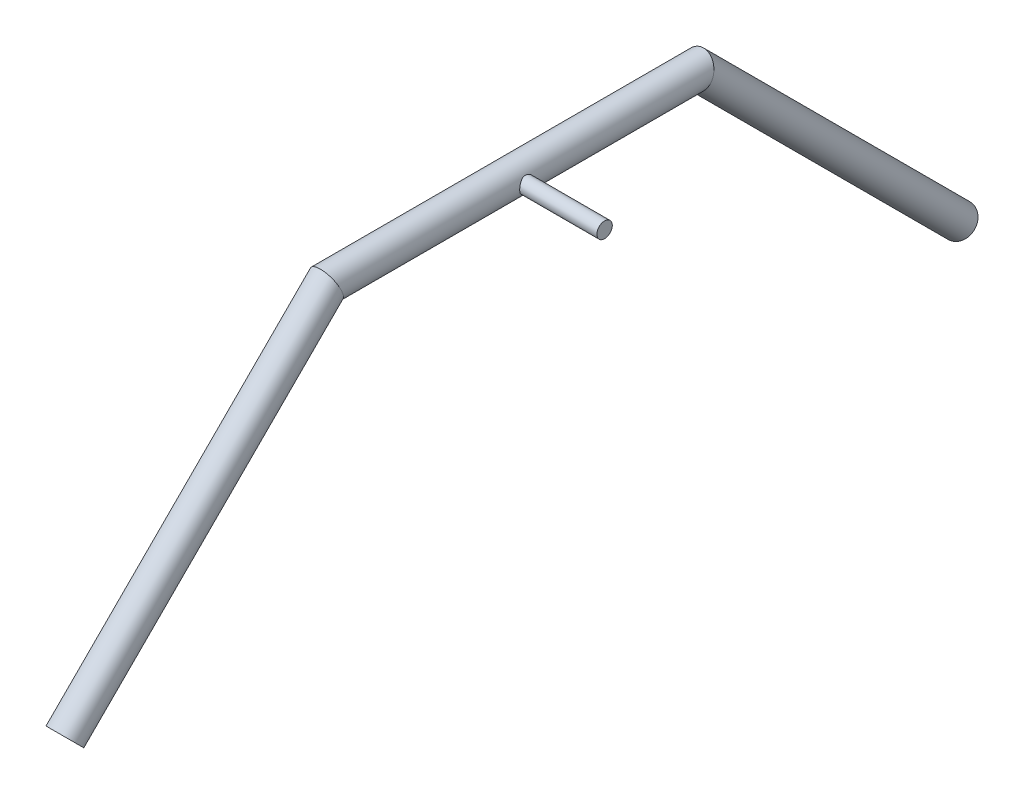
ISO-10303-21;
HEADER;
FILE_DESCRIPTION(('STEP AP214'),'2;1');
FILE_NAME('part.step','',(''),(''),'','','');
FILE_SCHEMA(('AUTOMOTIVE_DESIGN { 1 0 10303 214 1 1 1 1 }'));
ENDSEC;
DATA;
#1=APPLICATION_CONTEXT('core data for automotive mechanical design processes');
#2=APPLICATION_PROTOCOL_DEFINITION('international standard','automotive_design',2000,#1);
#3=PRODUCT_CONTEXT('',#1,'mechanical');
#4=PRODUCT('Part','Part','',(#3));
#5=PRODUCT_RELATED_PRODUCT_CATEGORY('part','',(#4));
#6=PRODUCT_DEFINITION_FORMATION('','',#4);
#7=PRODUCT_DEFINITION_CONTEXT('part definition',#1,'design');
#8=PRODUCT_DEFINITION('design','',#6,#7);
#9=PRODUCT_DEFINITION_SHAPE('','',#8);
#10=(LENGTH_UNIT() NAMED_UNIT(*) SI_UNIT(.MILLI.,.METRE.));
#11=(NAMED_UNIT(*) PLANE_ANGLE_UNIT() SI_UNIT($,.RADIAN.));
#12=(NAMED_UNIT(*) SI_UNIT($,.STERADIAN.) SOLID_ANGLE_UNIT());
#13=UNCERTAINTY_MEASURE_WITH_UNIT(LENGTH_MEASURE(1.E-05),#10,'distance_accuracy_value','');
#14=(GEOMETRIC_REPRESENTATION_CONTEXT(3) GLOBAL_UNCERTAINTY_ASSIGNED_CONTEXT((#13)) GLOBAL_UNIT_ASSIGNED_CONTEXT((#10,
#11,#12)) REPRESENTATION_CONTEXT('',''));
#15=CARTESIAN_POINT('',(0.,0.,0.));
#16=DIRECTION('',(0.,0.,1.));
#17=DIRECTION('',(1.,0.,0.));
#18=AXIS2_PLACEMENT_3D('',#15,#16,#17);
#19=CARTESIAN_POINT('',(0.,-1.4897870406127,38.5426953965743));
#20=DIRECTION('',(0.,0.,-1.));
#21=DIRECTION('',(-1.,0.,0.));
#22=AXIS2_PLACEMENT_3D('',#19,#20,#21);
#23=CYLINDRICAL_SURFACE('',#22,12.7);
#24=CARTESIAN_POINT('',(0.,-1.4897870406127,32.6561319302221));
#25=DIRECTION('',(0.,0.382683432365091,-0.923879532511286));
#26=DIRECTION('',(0.,0.923879532511286,0.382683432365091));
#27=AXIS2_PLACEMENT_3D('',#24,#25,#26);
#28=ELLIPSE('',#27,13.7463809437134,12.7);
#29=CARTESIAN_POINT('',(0.,11.2102129593873,37.9166441723604));
#30=VERTEX_POINT('',#29);
#31=EDGE_CURVE('E62',#30,#30,#28,.T.);
#32=ORIENTED_EDGE('',*,*,#31,.T.);
#33=EDGE_LOOP('',(#32));
#34=FACE_BOUND('',#33,.T.);
#35=CARTESIAN_POINT('',(0.,-1.4897870406127,-272.143868069778));
#36=DIRECTION('',(0.,-0.382683432365091,-0.923879532511286));
#37=DIRECTION('',(0.,0.923879532511287,-0.382683432365091));
#38=AXIS2_PLACEMENT_3D('',#35,#36,#37);
#39=ELLIPSE('',#38,13.7463809437134,12.7);
#40=CARTESIAN_POINT('',(0.,11.2102129593873,-277.404380311916));
#41=VERTEX_POINT('',#40);
#42=EDGE_CURVE('E124',#41,#41,#39,.T.);
#43=ORIENTED_EDGE('',*,*,#42,.F.);
#44=EDGE_LOOP('',(#43));
#45=FACE_BOUND('',#44,.T.);
#46=CARTESIAN_POINT('',(12.7,-1.4897870406127,-113.393868069778));
#47=CARTESIAN_POINT('',(12.6999994891774,-1.65677791980761,-113.393868627602));
#48=CARTESIAN_POINT('',(12.6966986728259,-1.82378049081133,-113.400462898579));
#49=CARTESIAN_POINT('',(12.6835786203218,-2.15655556725274,-113.42676474111));
#50=CARTESIAN_POINT('',(12.6737565484519,-2.32232750583582,-113.44647801737));
#51=CARTESIAN_POINT('',(12.6478292478082,-2.65156171789673,-113.498821868467));
#52=CARTESIAN_POINT('',(12.6317150589571,-2.81502035168104,-113.531470864958));
#53=CARTESIAN_POINT('',(12.5936085062318,-3.13828052309058,-113.609324399755));
#54=CARTESIAN_POINT('',(12.5716137398496,-3.29808053695416,-113.654534070016));
#55=CARTESIAN_POINT('',(12.5223959142721,-3.61222884940147,-113.756806889449));
#56=CARTESIAN_POINT('',(12.4951959650805,-3.76659780219676,-113.813817731834));
#57=CARTESIAN_POINT('',(12.436150269919,-4.06972158298842,-113.939267791719));
#58=CARTESIAN_POINT('',(12.4043027843762,-4.2184742824637,-114.007711289855));
#59=CARTESIAN_POINT('',(12.302881193969,-4.65491516254916,-114.229276396264));
#60=CARTESIAN_POINT('',(12.2273713354024,-4.93313208018793,-114.398746428739));
#61=CARTESIAN_POINT('',(12.0622186773861,-5.47450500182983,-114.787810575792));
#62=CARTESIAN_POINT('',(11.9719972312188,-5.73573158675631,-115.009816827984));
#63=CARTESIAN_POINT('',(11.7893960148839,-6.21915257216465,-115.492719878581));
#64=CARTESIAN_POINT('',(11.6970146601478,-6.44131722841707,-115.753646036034));
#65=CARTESIAN_POINT('',(11.5603243398217,-6.74934102839498,-116.181043203069));
#66=CARTESIAN_POINT('',(11.5134721485475,-6.85084974552579,-116.335664176016));
#67=CARTESIAN_POINT('',(11.4233099497228,-7.04037072821734,-116.653920454303));
#68=CARTESIAN_POINT('',(11.3799984680683,-7.12838862390478,-116.817551960308));
#69=CARTESIAN_POINT('',(11.2984098057888,-7.2901451235037,-117.152920205373));
#70=CARTESIAN_POINT('',(11.2601322945723,-7.36388466525522,-117.324656411172));
#71=CARTESIAN_POINT('',(11.1900882100937,-7.49624492897789,-117.675051126578));
#72=CARTESIAN_POINT('',(11.1583177917589,-7.55487458477507,-117.85370547357));
#73=CARTESIAN_POINT('',(11.104259497995,-7.65325884822883,-118.205844278748));
#74=CARTESIAN_POINT('',(11.08151961136,-7.69392953173717,-118.379003087267));
#75=CARTESIAN_POINT('',(11.0438804844397,-7.76068645741718,-118.728957979682));
#76=CARTESIAN_POINT('',(11.0289809087597,-7.78677332346183,-118.905753907653));
#77=CARTESIAN_POINT('',(11.0076763086804,-7.82394237980647,-119.261277364542));
#78=CARTESIAN_POINT('',(11.0012640993806,-7.83503726159646,-119.440003130374));
#79=CARTESIAN_POINT('',(10.9972004886715,-7.84207814818819,-119.797844612084));
#80=CARTESIAN_POINT('',(10.9995482514047,-7.83802559832464,-119.976960289129));
#81=CARTESIAN_POINT('',(11.012090292946,-7.81623881197733,-120.312450371653));
#82=CARTESIAN_POINT('',(11.0213095833287,-7.80020403536759,-120.468975429648));
#83=CARTESIAN_POINT('',(11.046128374712,-7.7566583855275,-120.779958604436));
#84=CARTESIAN_POINT('',(11.0617299789813,-7.72914372908407,-120.934416022499));
#85=CARTESIAN_POINT('',(11.0988027904553,-7.66295577509789,-121.24017936648));
#86=CARTESIAN_POINT('',(11.120273227066,-7.62428394248658,-121.391485703337));
#87=CARTESIAN_POINT('',(11.1684190383084,-7.53618489638032,-121.690106711781));
#88=CARTESIAN_POINT('',(11.1950964580098,-7.48675345611197,-121.83741978902));
#89=CARTESIAN_POINT('',(11.2831376118079,-7.32046703973683,-122.278796796713));
#90=CARTESIAN_POINT('',(11.351625656313,-7.18711862051005,-122.565418631972));
#91=CARTESIAN_POINT('',(11.500071400071,-6.88118584643924,-123.113444919895));
#92=CARTESIAN_POINT('',(11.5800342452273,-6.7085838678192,-123.374837970208));
#93=CARTESIAN_POINT('',(11.7546812882032,-6.30352420368694,-123.900055500737));
#94=CARTESIAN_POINT('',(11.8499465086129,-6.06625199945793,-124.159985740129));
#95=CARTESIAN_POINT('',(12.0362854764244,-5.5509097911418,-124.63807147064));
#96=CARTESIAN_POINT('',(12.1273572049436,-5.27282040062726,-124.856206996919));
#97=CARTESIAN_POINT('',(12.255938857257,-4.82265347800967,-125.152089444295));
#98=CARTESIAN_POINT('',(12.2983050254296,-4.66314426671061,-125.2472279165));
#99=CARTESIAN_POINT('',(12.3782218301755,-4.33548475687708,-125.423574781022));
#100=CARTESIAN_POINT('',(12.4157746297482,-4.16733838757132,-125.504789435907));
#101=CARTESIAN_POINT('',(12.4849579292559,-3.82357464405201,-125.652414640885));
#102=CARTESIAN_POINT('',(12.5165907293456,-3.64796020416409,-125.718830942643));
#103=CARTESIAN_POINT('',(12.5729876360055,-3.29053512580538,-125.83608972976));
#104=CARTESIAN_POINT('',(12.5977525327026,-3.10872520280673,-125.886934006693));
#105=CARTESIAN_POINT('',(12.6378915597613,-2.755723395467,-125.968815029523));
#106=CARTESIAN_POINT('',(12.6538736459652,-2.58489947760057,-126.001143656087));
#107=CARTESIAN_POINT('',(12.6789562420375,-2.24067835946114,-126.051713658141));
#108=CARTESIAN_POINT('',(12.6880571262137,-2.06728129967925,-126.069955799878));
#109=CARTESIAN_POINT('',(12.6991158370576,-1.71941665198612,-126.092106793677));
#110=CARTESIAN_POINT('',(12.7010765197081,-1.54494952006627,-126.096021376571));
#111=CARTESIAN_POINT('',(12.6978059034872,-1.19635653319513,-126.089479461829));
#112=CARTESIAN_POINT('',(12.6925749229034,-1.02223066348186,-126.079023600198));
#113=CARTESIAN_POINT('',(12.6757555094506,-0.689277503868629,-126.045254438257));
#114=CARTESIAN_POINT('',(12.6646934781011,-0.530314153448554,-126.023004995776));
#115=CARTESIAN_POINT('',(12.6368459564446,-0.214958640091404,-125.966646907296));
#116=CARTESIAN_POINT('',(12.6200585231077,-0.0585673689527108,-125.932534235195));
#117=CARTESIAN_POINT('',(12.581159973299,0.250520728027685,-125.852820116819));
#118=CARTESIAN_POINT('',(12.5590505630802,0.403218720721145,-125.807222352506));
#119=CARTESIAN_POINT('',(12.5099971792976,0.704118660112634,-125.704953678719));
#120=CARTESIAN_POINT('',(12.4830513245292,0.852318831001327,-125.648278459746));
#121=CARTESIAN_POINT('',(12.4240951779885,1.1474715217762,-125.522605775806));
#122=CARTESIAN_POINT('',(12.3919635638501,1.29427118289351,-125.453306064681));
#123=CARTESIAN_POINT('',(12.32392525103,1.58148052651925,-125.3040866757));
#124=CARTESIAN_POINT('',(12.2880172735192,1.72188802116851,-125.224163397842));
#125=CARTESIAN_POINT('',(12.1757741292216,2.13248672384417,-124.969318956096));
#126=CARTESIAN_POINT('',(12.0948877082824,2.39220836067138,-124.77925699099));
#127=CARTESIAN_POINT('',(11.9194499483036,2.90301290089874,-124.342728225611));
#128=CARTESIAN_POINT('',(11.8243367236915,3.1507428631143,-124.092555264645));
#129=CARTESIAN_POINT('',(11.6839772811164,3.48913691378379,-123.688957979926));
#130=CARTESIAN_POINT('',(11.6375432562751,3.59646676191905,-123.549591964638));
#131=CARTESIAN_POINT('',(11.5466734049483,3.79951204817738,-123.261934327099));
#132=CARTESIAN_POINT('',(11.5022378780468,3.89522574861524,-123.1136413744));
#133=CARTESIAN_POINT('',(11.4145838039713,4.07870685010253,-122.801439969167));
#134=CARTESIAN_POINT('',(11.3715304916549,4.16585845529205,-122.637122625727));
#135=CARTESIAN_POINT('',(11.290579644901,4.3257820531541,-122.300497535878));
#136=CARTESIAN_POINT('',(11.2526796279935,4.39856097720213,-122.128193690789));
#137=CARTESIAN_POINT('',(11.1834979926119,4.52891889153224,-121.776788905619));
#138=CARTESIAN_POINT('',(11.1522110654535,4.58651008309703,-121.597693554719));
#139=CARTESIAN_POINT('',(11.0975495796607,4.68577900994958,-121.233969731758));
#140=CARTESIAN_POINT('',(11.0741737959829,4.72745920918875,-121.049342121194));
#141=CARTESIAN_POINT('',(11.038221566145,4.79104599178573,-120.694129811253));
#142=CARTESIAN_POINT('',(11.0248238589961,4.81446663513222,-120.523898370593));
#143=CARTESIAN_POINT('',(11.0059068618669,4.84743482684167,-120.181662096087));
#144=CARTESIAN_POINT('',(11.0003870360907,4.85698331868744,-120.009657383646));
#145=CARTESIAN_POINT('',(10.9974561088362,4.86206051588589,-119.665436786344));
#146=CARTESIAN_POINT('',(11.0000420081603,4.85759440677727,-119.493221003152));
#147=CARTESIAN_POINT('',(11.0132073594892,4.83472372634817,-119.150034403732));
#148=CARTESIAN_POINT('',(11.023786484255,4.8163197256387,-118.979063536827));
#149=CARTESIAN_POINT('',(11.0511312712702,4.76826216657192,-118.656038379882));
#150=CARTESIAN_POINT('',(11.0672085028909,4.73985282658711,-118.503738751757));
#151=CARTESIAN_POINT('',(11.1050268373618,4.67218235062066,-118.20226770911));
#152=CARTESIAN_POINT('',(11.1267698205995,4.63291761161248,-118.053097350945));
#153=CARTESIAN_POINT('',(11.1995485940621,4.49941051488456,-117.61164373819));
#154=CARTESIAN_POINT('',(11.2581531108883,4.38942391610102,-117.325211050686));
#155=CARTESIAN_POINT('',(11.3937155944897,4.12243005274277,-116.755352064246));
#156=CARTESIAN_POINT('',(11.4716421113511,3.962760152483,-116.473420672326));
#157=CARTESIAN_POINT('',(11.635439817654,3.60388616889509,-115.938494996407));
#158=CARTESIAN_POINT('',(11.7213151279082,3.40466151762678,-115.685515875545));
#159=CARTESIAN_POINT('',(11.9038699110716,2.94375331211603,-115.18362981464));
#160=CARTESIAN_POINT('',(12.0005943076297,2.67742190853151,-114.938952637043));
#161=CARTESIAN_POINT('',(12.1383310810892,2.24834930257089,-114.607562019804));
#162=CARTESIAN_POINT('',(12.1830529217553,2.10025865671271,-114.502962977824));
#163=CARTESIAN_POINT('',(12.2688872478125,1.7949488582359,-114.306412892178));
#164=CARTESIAN_POINT('',(12.3100013738234,1.63773390953138,-114.214456088518));
#165=CARTESIAN_POINT('',(12.3878055405892,1.31382473336567,-114.043334961263));
#166=CARTESIAN_POINT('',(12.4244591999769,1.14706700677187,-113.964274249818));
#167=CARTESIAN_POINT('',(12.4919115290982,0.806356957012716,-113.82066178436));
#168=CARTESIAN_POINT('',(12.5227130740716,0.632408218327429,-113.756102902501));
#169=CARTESIAN_POINT('',(12.5775008101552,0.278938300784715,-113.642351329438));
#170=CARTESIAN_POINT('',(12.6015018553988,0.0994302321593499,-113.593125123776));
#171=CARTESIAN_POINT('',(12.642019952057,-0.263936499781345,-113.510532800744));
#172=CARTESIAN_POINT('',(12.6585415748002,-0.447792433229217,-113.477156995197));
#173=CARTESIAN_POINT('',(12.6806500718221,-0.774724011958794,-113.432635507854));
#174=CARTESIAN_POINT('',(12.6878936037074,-0.917238227961638,-113.41811016793));
#175=CARTESIAN_POINT('',(12.6975688534566,-1.20309442242374,-113.398726076059));
#176=CARTESIAN_POINT('',(12.7000004385074,-1.34643642362093,-113.393867590923));
#177=CARTESIAN_POINT('',(12.7,-1.4897870406127,-113.393868069778));
#178=B_SPLINE_CURVE_WITH_KNOTS('',3,(#46,#47,#48,#49,#50,#51,#52,#53,#54,#55,#56,#57,#58,#59,
#60,#61,#62,#63,#64,#65,#66,#67,#68,#69,#70,#71,#72,#73,#74,#75,#76,#77,#78,#79,#80,#81,#82,#83,
#84,#85,#86,#87,#88,#89,#90,#91,#92,#93,#94,#95,#96,#97,#98,#99,#100,#101,#102,#103,#104,#105,
#106,#107,#108,#109,#110,#111,#112,#113,#114,#115,#116,#117,#118,#119,#120,#121,#122,#123,#124,
#125,#126,#127,#128,#129,#130,#131,#132,#133,#134,#135,#136,#137,#138,#139,#140,#141,#142,#143,
#144,#145,#146,#147,#148,#149,#150,#151,#152,#153,#154,#155,#156,#157,#158,#159,#160,#161,#162,
#163,#164,#165,#166,#167,#168,#169,#170,#171,#172,#173,#174,#175,#176,#177),.UNSPECIFIED.,.T.,
.F.,(4,2,2,2,2,2,2,2,2,2,2,2,2,2,2,2,2,2,2,2,2,2,2,2,2,2,2,2,2,2,2,2,2,2,2,2,2,2,2,2,2,2,2,2,2,
2,2,2,2,2,2,2,2,2,2,2,2,2,2,2,2,2,2,2,2,4),(0.,0.500831224205358,1.00188037372803,
1.50364564290689,2.00561622220709,2.50540779268628,3.0053869172507,4.00425210956755,
5.06354639773445,6.12364383897771,6.69546056113471,7.26703799333406,7.83857787007115,
8.40977904053157,8.94696617231633,9.48413032231424,10.020839449589,10.5574973665628,
11.0297819407841,11.5022222802448,11.9746006167424,12.447164856978,13.4133450583963,
14.3799599077214,15.4691385823986,16.558836254714,17.1296896955319,17.7002857039293,
18.2706595507725,18.840967750957,19.3640345307036,19.8870728558157,20.4099019497636,
20.9327079051584,21.4148301207384,21.8971161172382,22.3792476958437,22.8615672144633,
23.3574791185916,23.8535595025871,24.845213267335,25.9342484207188,26.4795520760264,
27.0249372042285,27.5969396508644,28.1686655660688,28.7399307681393,29.3111074690516,
29.8274552059118,30.3437678229116,30.8598894217494,31.3759898919437,31.8427315926275,
32.3096283963947,33.2427989036526,34.2386648311406,35.2350499582129,36.3525027406484,
36.9121724680044,37.4715863502977,38.0352942497766,38.5987244700202,39.1609143479984,
39.7227601571806,40.1526787482413,40.5826092051903),.UNSPECIFIED.);
#179=CARTESIAN_POINT('',(12.7,-1.4897870406127,-113.393868069778));
#180=VERTEX_POINT('',#179);
#181=EDGE_CURVE('E11',#180,#180,#178,.T.);
#182=ORIENTED_EDGE('',*,*,#181,.F.);
#183=EDGE_LOOP('',(#182));
#184=FACE_BOUND('',#183,.T.);
#185=ADVANCED_FACE('F49',(#34,#45,#184),#23,.T.);
#186=CARTESIAN_POINT('',(0.,-1.48978704061267,37.0960545299863));
#187=DIRECTION('',(0.,0.,-1.));
#188=DIRECTION('',(-1.,0.,0.));
#189=AXIS2_PLACEMENT_3D('',#186,#187,#188);
#190=CYLINDRICAL_SURFACE('',#189,9.525);
#191=CARTESIAN_POINT('',(0.,-1.48978704061267,-272.143868069778));
#192=DIRECTION('',(0.,-0.382683432365091,-0.923879532511287));
#193=DIRECTION('',(0.,0.923879532511287,-0.382683432365091));
#194=AXIS2_PLACEMENT_3D('',#191,#192,#193);
#195=ELLIPSE('',#194,10.3097857077851,9.525);
#196=CARTESIAN_POINT('',(0.,8.03521295938733,-276.089252251382));
#197=VERTEX_POINT('',#196);
#198=EDGE_CURVE('E136',#197,#197,#195,.T.);
#199=ORIENTED_EDGE('',*,*,#198,.T.);
#200=EDGE_LOOP('',(#199));
#201=FACE_BOUND('',#200,.T.);
#202=CARTESIAN_POINT('',(0.,-1.48978704061256,32.6561319302221));
#203=DIRECTION('',(0.,0.382683432365091,-0.923879532511287));
#204=DIRECTION('',(0.,0.923879532511287,0.382683432365091));
#205=AXIS2_PLACEMENT_3D('',#202,#203,#204);
#206=ELLIPSE('',#205,10.3097857077851,9.525);
#207=CARTESIAN_POINT('',(0.,8.03521295938744,36.6015161118259));
#208=VERTEX_POINT('',#207);
#209=EDGE_CURVE('E134',#208,#208,#206,.T.);
#210=ORIENTED_EDGE('',*,*,#209,.F.);
#211=EDGE_LOOP('',(#210));
#212=FACE_BOUND('',#211,.T.);
#213=CARTESIAN_POINT('',(9.52500000000001,-1.4897870406127,-113.393868069778));
#214=CARTESIAN_POINT('',(9.52499995302127,-1.64930922529285,-113.393868116678));
#215=CARTESIAN_POINT('',(9.52098401348312,-1.80883221666415,-113.399887291772));
#216=CARTESIAN_POINT('',(9.50502147249805,-2.12657409223065,-113.423869032869));
#217=CARTESIAN_POINT('',(9.49307482930957,-2.28479296955748,-113.441831661733));
#218=CARTESIAN_POINT('',(9.46153969282097,-2.59874758910036,-113.489435560633));
#219=CARTESIAN_POINT('',(9.44194822064128,-2.75448233870052,-113.519081383179));
#220=CARTESIAN_POINT('',(9.39559036683439,-3.06228048590965,-113.589625713896));
#221=CARTESIAN_POINT('',(9.36882389844983,-3.21434383910125,-113.630524358131));
#222=CARTESIAN_POINT('',(9.30886537420495,-3.51308617199159,-113.722815357228));
#223=CARTESIAN_POINT('',(9.2757059421349,-3.65978817181756,-113.774154503377));
#224=CARTESIAN_POINT('',(9.2035713113691,-3.94783217303828,-113.886866631401));
#225=CARTESIAN_POINT('',(9.1645938472794,-4.08917205955641,-113.948243522615));
#226=CARTESIAN_POINT('',(9.04008640647303,-4.50402258574737,-114.146486048555));
#227=CARTESIAN_POINT('',(8.94692755885441,-4.76862219208656,-114.297544537793));
#228=CARTESIAN_POINT('',(8.73846290686175,-5.29120746012685,-114.646915476657));
#229=CARTESIAN_POINT('',(8.62194858766981,-5.54672657395838,-114.84815002851));
#230=CARTESIAN_POINT('',(8.38142132332393,-6.02283653690501,-115.285331001584));
#231=CARTESIAN_POINT('',(8.25739778727135,-6.24337638777616,-115.52132715493));
#232=CARTESIAN_POINT('',(8.06347927572664,-6.56173796199019,-115.918602359765));
#233=CARTESIAN_POINT('',(7.99276165906505,-6.67215605585161,-116.06954997759));
#234=CARTESIAN_POINT('',(7.85423181855953,-6.87980175525613,-116.381517753631));
#235=CARTESIAN_POINT('',(7.78642025681812,-6.9770263656721,-116.542540186906));
#236=CARTESIAN_POINT('',(7.59098753954933,-7.24754365030399,-117.039668971679));
#237=CARTESIAN_POINT('',(7.47095386772018,-7.40032724740184,-117.39063937361));
#238=CARTESIAN_POINT('',(7.30173884021222,-7.60720858103283,-118.019018551067));
#239=CARTESIAN_POINT('',(7.24210690604665,-7.67706306488747,-118.288408303811));
#240=CARTESIAN_POINT('',(7.17443610973183,-7.75510524308877,-118.700845704673));
#241=CARTESIAN_POINT('',(7.15551189712762,-7.77665944849341,-118.839660113549));
#242=CARTESIAN_POINT('',(7.1255840953054,-7.81056299642999,-119.119284759294));
#243=CARTESIAN_POINT('',(7.11458054949506,-7.82291228851621,-119.260095007098));
#244=CARTESIAN_POINT('',(7.10093685388961,-7.83820605740571,-119.543217701081));
#245=CARTESIAN_POINT('',(7.09833152574747,-7.84111137694439,-119.685533953271));
#246=CARTESIAN_POINT('',(7.10169083317634,-7.83735497956311,-119.969937038923));
#247=CARTESIAN_POINT('',(7.10765549785802,-7.83069323014559,-120.112023871604));
#248=CARTESIAN_POINT('',(7.12790820220153,-7.80791818180331,-120.394914829016));
#249=CARTESIAN_POINT('',(7.14220075299526,-7.7917997602619,-120.5357182165));
#250=CARTESIAN_POINT('',(7.17852290817034,-7.75039243299932,-120.814979596537));
#251=CARTESIAN_POINT('',(7.20055576995174,-7.72509966623925,-120.953436575882));
#252=CARTESIAN_POINT('',(7.27478957681072,-7.63866607320999,-121.351731969154));
#253=CARTESIAN_POINT('',(7.33620201701265,-7.5658444005062,-121.607423262154));
#254=CARTESIAN_POINT('',(7.47743075866494,-7.39115778214636,-122.10301535485));
#255=CARTESIAN_POINT('',(7.55725311438592,-7.2892832795868,-122.34291092654));
#256=CARTESIAN_POINT('',(7.74586039676384,-7.03568875038075,-122.852250602729));
#257=CARTESIAN_POINT('',(7.85723391455877,-6.87804480236335,-123.117779629039));
#258=CARTESIAN_POINT('',(8.08646851184115,-6.52749939970247,-123.621794016285));
#259=CARTESIAN_POINT('',(8.20433746619289,-6.33455445952359,-123.860245427949));
#260=CARTESIAN_POINT('',(8.39189544489691,-5.99789459699153,-124.219821344461));
#261=CARTESIAN_POINT('',(8.46237649743462,-5.8644893271291,-124.350324467896));
#262=CARTESIAN_POINT('',(8.60065671785608,-5.58594052619248,-124.599684257906));
#263=CARTESIAN_POINT('',(8.66845667843422,-5.4408005038558,-124.718544382447));
#264=CARTESIAN_POINT('',(8.7996219217699,-5.13934790005115,-124.943732042199));
#265=CARTESIAN_POINT('',(8.86298939243476,-4.98304090880162,-125.05006577851));
#266=CARTESIAN_POINT('',(8.98365184167378,-4.65985791864928,-125.249243019022));
#267=CARTESIAN_POINT('',(9.04094848992311,-4.49298484604233,-125.342090235078));
#268=CARTESIAN_POINT('',(9.13738661743715,-4.18324340658336,-125.496396618687));
#269=CARTESIAN_POINT('',(9.17788544551756,-4.04208029265907,-125.560441075967));
#270=CARTESIAN_POINT('',(9.25313321006477,-3.7541369477202,-125.67846303454));
#271=CARTESIAN_POINT('',(9.28788331086878,-3.60735786158829,-125.732442574646));
#272=CARTESIAN_POINT('',(9.35089181550515,-3.30903750175028,-125.829706105766));
#273=CARTESIAN_POINT('',(9.37915430201628,-3.15749929162123,-125.872996824598));
#274=CARTESIAN_POINT('',(9.42858494827341,-2.85051403995657,-125.948374452535));
#275=CARTESIAN_POINT('',(9.44975299888663,-2.69506693833053,-125.980461189292));
#276=CARTESIAN_POINT('',(9.48456888164441,-2.38068351270774,-126.033090096963));
#277=CARTESIAN_POINT('',(9.49818341565516,-2.22173490092614,-126.053581158506));
#278=CARTESIAN_POINT('',(9.51741035483457,-1.90225761589235,-126.082487141627));
#279=CARTESIAN_POINT('',(9.52302274954712,-1.74172894057582,-126.090902047424));
#280=CARTESIAN_POINT('',(9.52610229035684,-1.42042447825188,-126.095521614299));
#281=CARTESIAN_POINT('',(9.52356977217138,-1.25964870170253,-126.091726778638));
#282=CARTESIAN_POINT('',(9.51042464732743,-0.939184424625408,-126.071988359065));
#283=CARTESIAN_POINT('',(9.49981238552947,-0.779495877985874,-126.056045293666));
#284=CARTESIAN_POINT('',(9.4718027732773,-0.473682198459496,-126.01380845069));
#285=CARTESIAN_POINT('',(9.45493707431771,-0.327395139882953,-125.988324486946));
#286=CARTESIAN_POINT('',(9.41480857349519,-0.0377575538528498,-125.927396236312));
#287=CARTESIAN_POINT('',(9.39154359951066,0.105591958718021,-125.891948567327));
#288=CARTESIAN_POINT('',(9.33908968905819,0.388431031950814,-125.811520190023));
#289=CARTESIAN_POINT('',(9.30990252412285,0.527921732770945,-125.766542332335));
#290=CARTESIAN_POINT('',(9.24615452254172,0.802405218616712,-125.667521825114));
#291=CARTESIAN_POINT('',(9.21159162148365,0.937396251376383,-125.613475692513));
#292=CARTESIAN_POINT('',(9.09628940016217,1.3506163102164,-125.431450953425));
#293=CARTESIAN_POINT('',(9.00716257089463,1.6200696720948,-125.288424795719));
#294=CARTESIAN_POINT('',(8.81384971588905,2.1319252609917,-124.96852574876));
#295=CARTESIAN_POINT('',(8.70965439960832,2.37431063452643,-124.791631956314));
#296=CARTESIAN_POINT('',(8.47581446020667,2.86583066768937,-124.37745259834));
#297=CARTESIAN_POINT('',(8.3447509597295,3.10997165179558,-124.13504052368));
#298=CARTESIAN_POINT('',(8.08261425005548,3.55639497814611,-123.61379892226));
#299=CARTESIAN_POINT('',(7.9515410962865,3.75864838894042,-123.334944440378));
#300=CARTESIAN_POINT('',(7.77027012491587,4.02007534760594,-122.904394815992));
#301=CARTESIAN_POINT('',(7.71474176600138,4.09738426015174,-122.765694765299));
#302=CARTESIAN_POINT('',(7.60792322109691,4.24198320330717,-122.481517245127));
#303=CARTESIAN_POINT('',(7.5566335387924,4.30927204398296,-122.336038973389));
#304=CARTESIAN_POINT('',(7.4599440456278,4.43313739453511,-122.038935896259));
#305=CARTESIAN_POINT('',(7.41453651392781,4.48972799257532,-121.887319498156));
#306=CARTESIAN_POINT('',(7.33120548567237,4.59160970275434,-121.578406981876));
#307=CARTESIAN_POINT('',(7.29327725021167,4.63690797458407,-121.421114535295));
#308=CARTESIAN_POINT('',(7.23250015831976,4.70846729314677,-121.130360055854));
#309=CARTESIAN_POINT('',(7.20816660455853,4.73668601156565,-120.997688600048));
#310=CARTESIAN_POINT('',(7.16642919594874,4.78467969495344,-120.729802980355));
#311=CARTESIAN_POINT('',(7.14902187990607,4.80445887770345,-120.594590121931));
#312=CARTESIAN_POINT('',(7.12177272282831,4.83527452613775,-120.322509025974));
#313=CARTESIAN_POINT('',(7.1119253418161,4.84631739404047,-120.185642075426));
#314=CARTESIAN_POINT('',(7.10016206836552,4.8594966329176,-119.911133097958));
#315=CARTESIAN_POINT('',(7.09824629168029,4.86163287390946,-119.773491059756));
#316=CARTESIAN_POINT('',(7.10242578322567,4.85695876359759,-119.49840396631));
#317=CARTESIAN_POINT('',(7.10852562465069,4.85014330503284,-119.360959068344));
#318=CARTESIAN_POINT('',(7.12849870958464,4.82767721589365,-119.087372489053));
#319=CARTESIAN_POINT('',(7.14237188936862,4.81202665774834,-118.951230797055));
#320=CARTESIAN_POINT('',(7.17737840896367,4.7721268682217,-118.681040810039));
#321=CARTESIAN_POINT('',(7.19851840065331,4.74786975793652,-118.546994551083));
#322=CARTESIAN_POINT('',(7.24732531577334,4.69109469490422,-118.281813102746));
#323=CARTESIAN_POINT('',(7.27499597014281,4.65857201925664,-118.150679624452));
#324=CARTESIAN_POINT('',(7.34411691812824,4.57595222521642,-117.857533768684));
#325=CARTESIAN_POINT('',(7.38727463760103,4.52348145286817,-117.696589931828));
#326=CARTESIAN_POINT('',(7.48081228796889,4.40670899653651,-117.381213232929));
#327=CARTESIAN_POINT('',(7.531194821228,4.34240304716916,-117.226782743032));
#328=CARTESIAN_POINT('',(7.63741566100001,4.20259470839168,-116.92482708684));
#329=CARTESIAN_POINT('',(7.69325954935143,4.12708082211867,-116.777309218248));
#330=CARTESIAN_POINT('',(7.80864869446419,3.96553281180321,-116.489763034014));
#331=CARTESIAN_POINT('',(7.86819375566852,3.87949924335199,-116.349734323397));
#332=CARTESIAN_POINT('',(8.05228150665759,3.60293394289837,-115.936255426986));
#333=CARTESIAN_POINT('',(8.18031359367672,3.39640411916301,-115.674708188016));
#334=CARTESIAN_POINT('',(8.37035628725425,3.05770176880967,-115.308721978129));
#335=CARTESIAN_POINT('',(8.43339844653293,2.93992157643046,-115.19106712991));
#336=CARTESIAN_POINT('',(8.55762624300504,2.69488650186075,-114.964872826424));
#337=CARTESIAN_POINT('',(8.61881160088007,2.56763020402791,-114.856334738292));
#338=CARTESIAN_POINT('',(8.74664952542504,2.28501736979934,-114.634057297877));
#339=CARTESIAN_POINT('',(8.81281921736053,2.12825418087689,-114.521822638893));
#340=CARTESIAN_POINT('',(8.93924181678019,1.80352681879335,-114.311188212662));
#341=CARTESIAN_POINT('',(8.99949728550241,1.63556754764219,-114.212782448574));
#342=CARTESIAN_POINT('',(9.11233491255446,1.28943578715884,-114.031023525024));
#343=CARTESIAN_POINT('',(9.16492428514217,1.11127312269909,-113.947656195711));
#344=CARTESIAN_POINT('',(9.26084237436768,0.745848262571908,-113.797151135933));
#345=CARTESIAN_POINT('',(9.30417434247485,0.5585892902488,-113.730007706074));
#346=CARTESIAN_POINT('',(9.37168114342143,0.219066818148169,-113.62615062778));
#347=CARTESIAN_POINT('',(9.39797327715977,0.0682689330680034,-113.585990591986));
#348=CARTESIAN_POINT('',(9.44349657410066,-0.236879860696988,-113.516735004393));
#349=CARTESIAN_POINT('',(9.46272919616698,-0.391230028280559,-113.487637166523));
#350=CARTESIAN_POINT('',(9.49367827215344,-0.70231226298595,-113.440923677682));
#351=CARTESIAN_POINT('',(9.50539918929339,-0.859042858949776,-113.423301208306));
#352=CARTESIAN_POINT('',(9.52106022240963,-1.17377768797301,-113.39977316138));
#353=CARTESIAN_POINT('',(9.52500004653198,-1.33178196858272,-113.393868023324));
#354=CARTESIAN_POINT('',(9.52500000000001,-1.4897870406127,-113.393868069778));
#355=B_SPLINE_CURVE_WITH_KNOTS('',3,(#213,#214,#215,#216,#217,#218,#219,#220,#221,#222,#223,
#224,#225,#226,#227,#228,#229,#230,#231,#232,#233,#234,#235,#236,#237,#238,#239,#240,#241,#242,
#243,#244,#245,#246,#247,#248,#249,#250,#251,#252,#253,#254,#255,#256,#257,#258,#259,#260,#261,
#262,#263,#264,#265,#266,#267,#268,#269,#270,#271,#272,#273,#274,#275,#276,#277,#278,#279,#280,
#281,#282,#283,#284,#285,#286,#287,#288,#289,#290,#291,#292,#293,#294,#295,#296,#297,#298,#299,
#300,#301,#302,#303,#304,#305,#306,#307,#308,#309,#310,#311,#312,#313,#314,#315,#316,#317,#318,
#319,#320,#321,#322,#323,#324,#325,#326,#327,#328,#329,#330,#331,#332,#333,#334,#335,#336,#337,
#338,#339,#340,#341,#342,#343,#344,#345,#346,#347,#348,#349,#350,#351,#352,#353,#354),
.UNSPECIFIED.,.T.,.F.,(4,2,2,2,2,2,2,2,2,2,2,2,2,2,2,2,2,2,2,2,2,2,2,2,2,2,2,2,2,2,2,2,2,2,2,2,
2,2,2,2,2,2,2,2,2,2,2,2,2,2,2,2,2,2,2,2,2,2,2,2,2,2,2,2,2,2,2,2,2,2,4),(0.,0.47840538061794,
0.956813279239054,1.4354077804509,1.91400806890837,2.3902277496366,2.8666333442711,
3.81862625068162,4.85140247863723,5.88567087629456,6.48485332921755,7.08417157918498,
8.27951533243021,9.12972915875145,9.55449841242711,9.97926999395051,10.4058005617562,
10.8323325784106,11.259095858237,11.6860389509021,12.5013302126937,13.3168899738091,
14.2983393334806,15.2810059330147,15.8788611327681,16.47653822789,17.0739181926961,
17.6711334295995,18.1513005477461,18.631370294298,19.1111370979202,19.5909112813935,
20.0727839793195,20.5546573068918,21.0365107728437,21.5183436734241,21.9661749409647,
22.414158404953,22.8620080586,23.3100301238974,24.2594691600945,25.2094960927675,
26.3097517407433,27.4107648115876,27.9150410851496,28.4193771963737,28.9230444657225,
29.4263915772578,29.8393858100912,30.2521734005924,30.6646582077437,31.077149034642,
31.4898753043957,31.9025981907154,32.3156998849318,32.7290381560639,33.2523652916645,
33.7758814044031,34.2999382884879,34.8239675067413,35.8903398922336,36.4240224132792,
36.9577848221176,37.5684710444783,38.1788916227338,38.7887339977982,39.3983618250757,
39.8725796504944,40.3466994224999,40.8205372255695,41.2943928010534),.UNSPECIFIED.);
#356=CARTESIAN_POINT('',(9.52500000000001,-1.4897870406127,-113.393868069778));
#357=VERTEX_POINT('',#356);
#358=EDGE_CURVE('E53',#357,#357,#355,.T.);
#359=ORIENTED_EDGE('',*,*,#358,.T.);
#360=EDGE_LOOP('',(#359));
#361=FACE_BOUND('',#360,.T.);
#362=ADVANCED_FACE('F96',(#201,#212,#361),#190,.F.);
#363=CARTESIAN_POINT('',(0.,-217.015933946273,-487.670014975437));
#364=DIRECTION('',(0.,0.707106781186548,0.707106781186547));
#365=DIRECTION('',(0.,-0.707106781186547,0.707106781186548));
#366=AXIS2_PLACEMENT_3D('',#363,#364,#365);
#367=PLANE('',#366);
#368=CARTESIAN_POINT('',(0.,-217.015933946273,-487.670014975437));
#369=DIRECTION('',(0.,0.707106781186548,0.707106781186547));
#370=DIRECTION('',(0.,-0.707106781186547,0.707106781186548));
#371=AXIS2_PLACEMENT_3D('',#368,#369,#370);
#372=CIRCLE('',#371,9.525);
#373=CARTESIAN_POINT('',(0.,-223.751126037075,-480.934822884635));
#374=VERTEX_POINT('',#373);
#375=EDGE_CURVE('E77',#374,#374,#372,.T.);
#376=ORIENTED_EDGE('',*,*,#375,.T.);
#377=EDGE_LOOP('',(#376));
#378=FACE_BOUND('',#377,.T.);
#379=CARTESIAN_POINT('',(0.,-217.015933946273,-487.670014975437));
#380=DIRECTION('',(0.,0.707106781186548,0.707106781186547));
#381=DIRECTION('',(0.,-0.707106781186547,0.707106781186548));
#382=AXIS2_PLACEMENT_3D('',#379,#380,#381);
#383=CIRCLE('',#382,12.7);
#384=CARTESIAN_POINT('',(0.,-225.996190067342,-478.689758854368));
#385=VERTEX_POINT('',#384);
#386=EDGE_CURVE('E125',#385,#385,#383,.T.);
#387=ORIENTED_EDGE('',*,*,#386,.F.);
#388=EDGE_LOOP('',(#387));
#389=FACE_BOUND('',#388,.T.);
#390=ADVANCED_FACE('F51',(#378,#389),#367,.F.);
#391=CARTESIAN_POINT('',(0.,-217.015933946273,248.182278835881));
#392=DIRECTION('',(0.,-0.707106781186549,0.707106781186546));
#393=DIRECTION('',(0.,-0.707106781186546,-0.707106781186549));
#394=AXIS2_PLACEMENT_3D('',#391,#392,#393);
#395=PLANE('',#394);
#396=CARTESIAN_POINT('',(0.,-217.015933946273,248.182278835881));
#397=DIRECTION('',(0.,-0.707106781186549,0.707106781186546));
#398=DIRECTION('',(0.,-0.707106781186546,-0.707106781186549));
#399=AXIS2_PLACEMENT_3D('',#396,#397,#398);
#400=CIRCLE('',#399,9.525);
#401=CARTESIAN_POINT('',(0.,-223.751126037075,241.44708674508));
#402=VERTEX_POINT('',#401);
#403=EDGE_CURVE('E130',#402,#402,#400,.T.);
#404=ORIENTED_EDGE('',*,*,#403,.F.);
#405=EDGE_LOOP('',(#404));
#406=FACE_BOUND('',#405,.T.);
#407=CARTESIAN_POINT('',(0.,-217.015933946273,248.182278835881));
#408=DIRECTION('',(0.,-0.707106781186549,0.707106781186546));
#409=DIRECTION('',(0.,-0.707106781186546,-0.707106781186549));
#410=AXIS2_PLACEMENT_3D('',#407,#408,#409);
#411=CIRCLE('',#410,12.7);
#412=CARTESIAN_POINT('',(0.,-225.996190067342,239.202022714812));
#413=VERTEX_POINT('',#412);
#414=EDGE_CURVE('E67',#413,#413,#411,.T.);
#415=ORIENTED_EDGE('',*,*,#414,.T.);
#416=EDGE_LOOP('',(#415));
#417=FACE_BOUND('',#416,.T.);
#418=ADVANCED_FACE('F111',(#406,#417),#395,.T.);
#419=CARTESIAN_POINT('',(0.,2.67264190432998,-267.981439124835));
#420=DIRECTION('',(0.,-0.707106781186549,-0.707106781186546));
#421=DIRECTION('',(0.,0.707106781186546,-0.707106781186549));
#422=AXIS2_PLACEMENT_3D('',#419,#420,#421);
#423=CYLINDRICAL_SURFACE('',#422,12.7);
#424=ORIENTED_EDGE('',*,*,#42,.T.);
#425=EDGE_LOOP('',(#424));
#426=FACE_BOUND('',#425,.T.);
#427=ORIENTED_EDGE('',*,*,#386,.T.);
#428=EDGE_LOOP('',(#427));
#429=FACE_BOUND('',#428,.T.);
#430=ADVANCED_FACE('F105',(#426,#429),#423,.T.);
#431=CARTESIAN_POINT('',(0.,-217.015933946273,248.182278835881));
#432=DIRECTION('',(0.,0.707106781186549,-0.707106781186546));
#433=DIRECTION('',(0.,0.707106781186546,0.707106781186549));
#434=AXIS2_PLACEMENT_3D('',#431,#432,#433);
#435=CYLINDRICAL_SURFACE('',#434,12.7);
#436=ORIENTED_EDGE('',*,*,#414,.F.);
#437=EDGE_LOOP('',(#436));
#438=FACE_BOUND('',#437,.T.);
#439=ORIENTED_EDGE('',*,*,#31,.F.);
#440=EDGE_LOOP('',(#439));
#441=FACE_BOUND('',#440,.T.);
#442=ADVANCED_FACE('F101',(#438,#441),#435,.T.);
#443=CARTESIAN_POINT('',(0.,-219.844361071018,251.010705960627));
#444=DIRECTION('',(0.,0.707106781186549,-0.707106781186546));
#445=DIRECTION('',(0.,0.707106781186546,0.707106781186549));
#446=AXIS2_PLACEMENT_3D('',#443,#444,#445);
#447=CYLINDRICAL_SURFACE('',#446,9.525);
#448=ORIENTED_EDGE('',*,*,#209,.T.);
#449=EDGE_LOOP('',(#448));
#450=FACE_BOUND('',#449,.T.);
#451=ORIENTED_EDGE('',*,*,#403,.T.);
#452=EDGE_LOOP('',(#451));
#453=FACE_BOUND('',#452,.T.);
#454=ADVANCED_FACE('F94',(#450,#453),#447,.F.);
#455=CARTESIAN_POINT('',(0.,1.64971233762404,-269.004368691541));
#456=DIRECTION('',(0.,-0.707106781186549,-0.707106781186546));
#457=DIRECTION('',(0.,0.707106781186546,-0.707106781186549));
#458=AXIS2_PLACEMENT_3D('',#455,#456,#457);
#459=CYLINDRICAL_SURFACE('',#458,9.525);
#460=ORIENTED_EDGE('',*,*,#375,.F.);
#461=EDGE_LOOP('',(#460));
#462=FACE_BOUND('',#461,.T.);
#463=ORIENTED_EDGE('',*,*,#198,.F.);
#464=EDGE_LOOP('',(#463));
#465=FACE_BOUND('',#464,.T.);
#466=ADVANCED_FACE('F91',(#462,#465),#459,.F.);
#467=CARTESIAN_POINT('',(0.,-1.4897870406127,-119.743868069778));
#468=DIRECTION('',(1.,0.,0.));
#469=DIRECTION('',(0.,0.,-1.));
#470=AXIS2_PLACEMENT_3D('',#467,#468,#469);
#471=PLANE('',#470);
#472=CARTESIAN_POINT('',(0.,-1.4897870406127,-119.743868069778));
#473=DIRECTION('',(1.,0.,0.));
#474=DIRECTION('',(0.,0.,-1.));
#475=AXIS2_PLACEMENT_3D('',#472,#473,#474);
#476=CIRCLE('',#475,6.35);
#477=CARTESIAN_POINT('',(0.,-1.4897870406127,-126.093868069778));
#478=VERTEX_POINT('',#477);
#479=EDGE_CURVE('E75',#478,#478,#476,.T.);
#480=ORIENTED_EDGE('',*,*,#479,.F.);
#481=EDGE_LOOP('',(#480));
#482=FACE_BOUND('',#481,.T.);
#483=ADVANCED_FACE('F88',(#482),#471,.F.);
#484=CARTESIAN_POINT('',(76.2,-1.4897870406127,-119.743868069778));
#485=DIRECTION('',(-1.,0.,0.));
#486=DIRECTION('',(0.,0.,1.));
#487=AXIS2_PLACEMENT_3D('',#484,#485,#486);
#488=CYLINDRICAL_SURFACE('',#487,6.35);
#489=ORIENTED_EDGE('',*,*,#358,.F.);
#490=EDGE_LOOP('',(#489));
#491=FACE_BOUND('',#490,.T.);
#492=ORIENTED_EDGE('',*,*,#479,.T.);
#493=EDGE_LOOP('',(#492));
#494=FACE_BOUND('',#493,.T.);
#495=ADVANCED_FACE('F82',(#491,#494),#488,.T.);
#496=CARTESIAN_POINT('',(76.2,-1.4897870406127,-119.743868069778));
#497=DIRECTION('',(1.,0.,0.));
#498=DIRECTION('',(0.,0.,-1.));
#499=AXIS2_PLACEMENT_3D('',#496,#497,#498);
#500=CIRCLE('',#499,6.35);
#501=CARTESIAN_POINT('',(76.2,-1.4897870406127,-126.093868069778));
#502=VERTEX_POINT('',#501);
#503=EDGE_CURVE('E143',#502,#502,#500,.T.);
#504=ORIENTED_EDGE('',*,*,#503,.F.);
#505=EDGE_LOOP('',(#504));
#506=FACE_BOUND('',#505,.T.);
#507=ORIENTED_EDGE('',*,*,#181,.T.);
#508=EDGE_LOOP('',(#507));
#509=FACE_BOUND('',#508,.T.);
#510=ADVANCED_FACE('F87',(#506,#509),#488,.T.);
#511=CARTESIAN_POINT('',(76.2,-1.4897870406127,-119.743868069778));
#512=DIRECTION('',(1.,0.,0.));
#513=DIRECTION('',(0.,0.,-1.));
#514=AXIS2_PLACEMENT_3D('',#511,#512,#513);
#515=PLANE('',#514);
#516=ORIENTED_EDGE('',*,*,#503,.T.);
#517=EDGE_LOOP('',(#516));
#518=FACE_BOUND('',#517,.T.);
#519=ADVANCED_FACE('F171',(#518),#515,.T.);
#520=CLOSED_SHELL('',(#185,#362,#390,#418,#430,#442,#454,#466,#483,#495,#510,#519));
#521=MANIFOLD_SOLID_BREP('B2',#520);
#522=ADVANCED_BREP_SHAPE_REPRESENTATION('',(#18,#521),#14);
#523=SHAPE_DEFINITION_REPRESENTATION(#9,#522);
ENDSEC;
END-ISO-10303-21;
